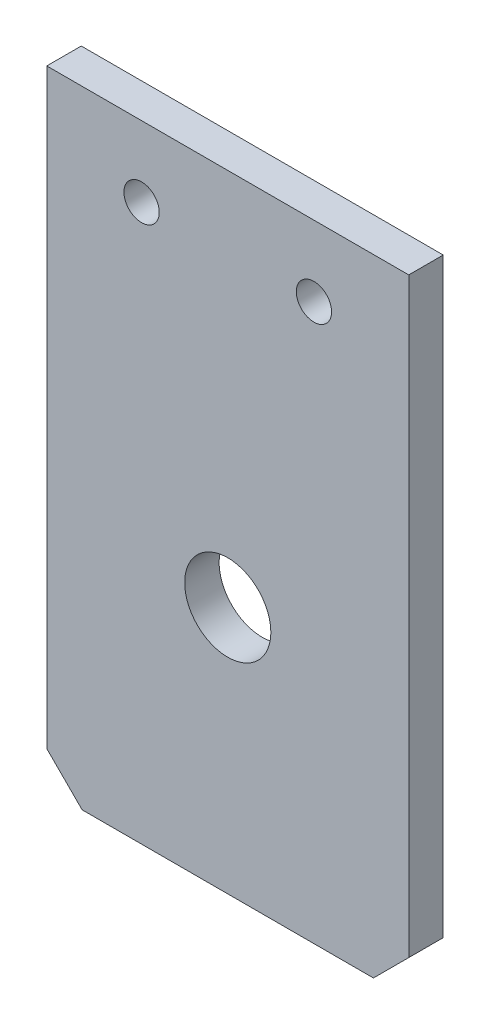
ISO-10303-21;
HEADER;
FILE_DESCRIPTION(('STEP AP214'),'2;1');
FILE_NAME('part.step','',(''),(''),'','','');
FILE_SCHEMA(('AUTOMOTIVE_DESIGN { 1 0 10303 214 1 1 1 1 }'));
ENDSEC;
DATA;
#1=APPLICATION_CONTEXT('core data for automotive mechanical design processes');
#2=APPLICATION_PROTOCOL_DEFINITION('international standard','automotive_design',2000,#1);
#3=PRODUCT_CONTEXT('',#1,'mechanical');
#4=PRODUCT('Part','Part','',(#3));
#5=PRODUCT_RELATED_PRODUCT_CATEGORY('part','',(#4));
#6=PRODUCT_DEFINITION_FORMATION('','',#4);
#7=PRODUCT_DEFINITION_CONTEXT('part definition',#1,'design');
#8=PRODUCT_DEFINITION('design','',#6,#7);
#9=PRODUCT_DEFINITION_SHAPE('','',#8);
#10=(LENGTH_UNIT() NAMED_UNIT(*) SI_UNIT(.MILLI.,.METRE.));
#11=(NAMED_UNIT(*) PLANE_ANGLE_UNIT() SI_UNIT($,.RADIAN.));
#12=(NAMED_UNIT(*) SI_UNIT($,.STERADIAN.) SOLID_ANGLE_UNIT());
#13=UNCERTAINTY_MEASURE_WITH_UNIT(LENGTH_MEASURE(1.E-05),#10,'distance_accuracy_value','');
#14=(GEOMETRIC_REPRESENTATION_CONTEXT(3) GLOBAL_UNCERTAINTY_ASSIGNED_CONTEXT((#13)) GLOBAL_UNIT_ASSIGNED_CONTEXT((#10,
#11,#12)) REPRESENTATION_CONTEXT('',''));
#15=CARTESIAN_POINT('',(0.,0.,0.));
#16=DIRECTION('',(0.,0.,1.));
#17=DIRECTION('',(1.,0.,0.));
#18=AXIS2_PLACEMENT_3D('',#15,#16,#17);
#19=CARTESIAN_POINT('',(0.,0.,4.));
#20=DIRECTION('',(0.,0.,1.));
#21=DIRECTION('',(1.,0.,0.));
#22=AXIS2_PLACEMENT_3D('',#19,#20,#21);
#23=PLANE('',#22);
#24=CARTESIAN_POINT('',(21.,21.08,4.));
#25=DIRECTION('',(0.,0.,1.));
#26=DIRECTION('',(1.,0.,0.));
#27=AXIS2_PLACEMENT_3D('',#24,#25,#26);
#28=CIRCLE('',#27,5.);
#29=CARTESIAN_POINT('',(26.,21.08,4.));
#30=VERTEX_POINT('',#29);
#31=EDGE_CURVE('E139',#30,#30,#28,.T.);
#32=ORIENTED_EDGE('',*,*,#31,.F.);
#33=EDGE_LOOP('',(#32));
#34=FACE_BOUND('',#33,.T.);
#35=CARTESIAN_POINT('',(11.,56.8,4.));
#36=DIRECTION('',(0.,0.,1.));
#37=DIRECTION('',(1.,0.,0.));
#38=AXIS2_PLACEMENT_3D('',#35,#36,#37);
#39=CIRCLE('',#38,2.04999999999999);
#40=CARTESIAN_POINT('',(13.05,56.8,4.));
#41=VERTEX_POINT('',#40);
#42=EDGE_CURVE('E116',#41,#41,#39,.T.);
#43=ORIENTED_EDGE('',*,*,#42,.F.);
#44=EDGE_LOOP('',(#43));
#45=FACE_BOUND('',#44,.T.);
#46=DIRECTION('',(1.,0.,0.));
#47=VECTOR('',#46,1.);
#48=CARTESIAN_POINT('',(0.,-7.7,4.));
#49=LINE('',#48,#47);
#50=CARTESIAN_POINT('',(4.10000000000001,-7.7,4.));
#51=VERTEX_POINT('',#50);
#52=CARTESIAN_POINT('',(37.9,-7.7,4.));
#53=VERTEX_POINT('',#52);
#54=EDGE_CURVE('E140',#51,#53,#49,.T.);
#55=ORIENTED_EDGE('',*,*,#54,.T.);
#56=DIRECTION('',(0.707106781186547,0.707106781186548,0.));
#57=VECTOR('',#56,1.);
#58=CARTESIAN_POINT('',(22.8,-22.8,4.));
#59=LINE('',#58,#57);
#60=CARTESIAN_POINT('',(42.,-3.59999999999998,4.));
#61=VERTEX_POINT('',#60);
#62=EDGE_CURVE('E95',#53,#61,#59,.T.);
#63=ORIENTED_EDGE('',*,*,#62,.T.);
#64=DIRECTION('',(0.,1.,0.));
#65=VECTOR('',#64,1.);
#66=CARTESIAN_POINT('',(42.,65.,4.));
#67=LINE('',#66,#65);
#68=CARTESIAN_POINT('',(42.,65.,4.));
#69=VERTEX_POINT('',#68);
#70=EDGE_CURVE('E87',#61,#69,#67,.T.);
#71=ORIENTED_EDGE('',*,*,#70,.T.);
#72=DIRECTION('',(-1.,0.,0.));
#73=VECTOR('',#72,1.);
#74=CARTESIAN_POINT('',(0.,65.,4.));
#75=LINE('',#74,#73);
#76=CARTESIAN_POINT('',(0.,65.,4.));
#77=VERTEX_POINT('',#76);
#78=EDGE_CURVE('E93',#69,#77,#75,.T.);
#79=ORIENTED_EDGE('',*,*,#78,.T.);
#80=DIRECTION('',(0.,-1.,0.));
#81=VECTOR('',#80,1.);
#82=CARTESIAN_POINT('',(0.,65.,4.));
#83=LINE('',#82,#81);
#84=CARTESIAN_POINT('',(0.,-3.60000000000002,4.));
#85=VERTEX_POINT('',#84);
#86=EDGE_CURVE('E96',#77,#85,#83,.T.);
#87=ORIENTED_EDGE('',*,*,#86,.T.);
#88=DIRECTION('',(0.707106781186549,-0.707106781186546,0.));
#89=VECTOR('',#88,1.);
#90=CARTESIAN_POINT('',(-1.8,-1.80000000000001,4.));
#91=LINE('',#90,#89);
#92=EDGE_CURVE('E124',#85,#51,#91,.T.);
#93=ORIENTED_EDGE('',*,*,#92,.T.);
#94=EDGE_LOOP('',(#55,#63,#71,#79,#87,#93));
#95=FACE_BOUND('',#94,.T.);
#96=CARTESIAN_POINT('',(31.,56.8,4.));
#97=DIRECTION('',(0.,0.,1.));
#98=DIRECTION('',(1.,0.,0.));
#99=AXIS2_PLACEMENT_3D('',#96,#97,#98);
#100=CIRCLE('',#99,2.04999999999999);
#101=CARTESIAN_POINT('',(33.05,56.8,4.));
#102=VERTEX_POINT('',#101);
#103=EDGE_CURVE('E183',#102,#102,#100,.T.);
#104=ORIENTED_EDGE('',*,*,#103,.F.);
#105=EDGE_LOOP('',(#104));
#106=FACE_BOUND('',#105,.T.);
#107=ADVANCED_FACE('F33',(#34,#45,#95,#106),#23,.T.);
#108=CARTESIAN_POINT('',(0.,0.,0.));
#109=DIRECTION('',(0.,0.,1.));
#110=DIRECTION('',(1.,0.,0.));
#111=AXIS2_PLACEMENT_3D('',#108,#109,#110);
#112=PLANE('',#111);
#113=CARTESIAN_POINT('',(21.,21.08,0.));
#114=DIRECTION('',(0.,0.,1.));
#115=DIRECTION('',(1.,0.,0.));
#116=AXIS2_PLACEMENT_3D('',#113,#114,#115);
#117=CIRCLE('',#116,5.);
#118=CARTESIAN_POINT('',(26.,21.08,0.));
#119=VERTEX_POINT('',#118);
#120=EDGE_CURVE('E177',#119,#119,#117,.T.);
#121=ORIENTED_EDGE('',*,*,#120,.T.);
#122=EDGE_LOOP('',(#121));
#123=FACE_BOUND('',#122,.T.);
#124=DIRECTION('',(0.,1.,0.));
#125=VECTOR('',#124,1.);
#126=CARTESIAN_POINT('',(42.,65.,0.));
#127=LINE('',#126,#125);
#128=CARTESIAN_POINT('',(42.,-3.59999999999997,0.));
#129=VERTEX_POINT('',#128);
#130=CARTESIAN_POINT('',(42.,65.,0.));
#131=VERTEX_POINT('',#130);
#132=EDGE_CURVE('E101',#129,#131,#127,.T.);
#133=ORIENTED_EDGE('',*,*,#132,.F.);
#134=DIRECTION('',(-0.707106781186547,-0.707106781186548,0.));
#135=VECTOR('',#134,1.);
#136=CARTESIAN_POINT('',(37.9,-7.7,0.));
#137=LINE('',#136,#135);
#138=CARTESIAN_POINT('',(37.9,-7.7,0.));
#139=VERTEX_POINT('',#138);
#140=EDGE_CURVE('E41',#129,#139,#137,.T.);
#141=ORIENTED_EDGE('',*,*,#140,.T.);
#142=DIRECTION('',(1.,0.,0.));
#143=VECTOR('',#142,1.);
#144=CARTESIAN_POINT('',(0.,-7.7,0.));
#145=LINE('',#144,#143);
#146=CARTESIAN_POINT('',(4.10000000000001,-7.7,0.));
#147=VERTEX_POINT('',#146);
#148=EDGE_CURVE('E132',#147,#139,#145,.T.);
#149=ORIENTED_EDGE('',*,*,#148,.F.);
#150=DIRECTION('',(-0.707106781186549,0.707106781186546,0.));
#151=VECTOR('',#150,1.);
#152=CARTESIAN_POINT('',(0.,-3.60000000000001,0.));
#153=LINE('',#152,#151);
#154=CARTESIAN_POINT('',(0.,-3.60000000000002,0.));
#155=VERTEX_POINT('',#154);
#156=EDGE_CURVE('E48',#147,#155,#153,.T.);
#157=ORIENTED_EDGE('',*,*,#156,.T.);
#158=DIRECTION('',(0.,-1.,0.));
#159=VECTOR('',#158,1.);
#160=CARTESIAN_POINT('',(0.,65.,0.));
#161=LINE('',#160,#159);
#162=CARTESIAN_POINT('',(0.,65.,0.));
#163=VERTEX_POINT('',#162);
#164=EDGE_CURVE('E114',#163,#155,#161,.T.);
#165=ORIENTED_EDGE('',*,*,#164,.F.);
#166=DIRECTION('',(-1.,0.,0.));
#167=VECTOR('',#166,1.);
#168=CARTESIAN_POINT('',(0.,65.,0.));
#169=LINE('',#168,#167);
#170=EDGE_CURVE('E118',#131,#163,#169,.T.);
#171=ORIENTED_EDGE('',*,*,#170,.F.);
#172=EDGE_LOOP('',(#133,#141,#149,#157,#165,#171));
#173=FACE_BOUND('',#172,.T.);
#174=CARTESIAN_POINT('',(11.,56.8,0.));
#175=DIRECTION('',(0.,0.,1.));
#176=DIRECTION('',(1.,0.,0.));
#177=AXIS2_PLACEMENT_3D('',#174,#175,#176);
#178=CIRCLE('',#177,2.04999999999999);
#179=CARTESIAN_POINT('',(13.05,56.8,0.));
#180=VERTEX_POINT('',#179);
#181=EDGE_CURVE('E186',#180,#180,#178,.T.);
#182=ORIENTED_EDGE('',*,*,#181,.T.);
#183=EDGE_LOOP('',(#182));
#184=FACE_BOUND('',#183,.T.);
#185=CARTESIAN_POINT('',(31.,56.8,0.));
#186=DIRECTION('',(0.,0.,1.));
#187=DIRECTION('',(1.,0.,0.));
#188=AXIS2_PLACEMENT_3D('',#185,#186,#187);
#189=CIRCLE('',#188,2.04999999999999);
#190=CARTESIAN_POINT('',(33.05,56.8,0.));
#191=VERTEX_POINT('',#190);
#192=EDGE_CURVE('E180',#191,#191,#189,.T.);
#193=ORIENTED_EDGE('',*,*,#192,.T.);
#194=EDGE_LOOP('',(#193));
#195=FACE_BOUND('',#194,.T.);
#196=ADVANCED_FACE('F130',(#123,#173,#184,#195),#112,.F.);
#197=CARTESIAN_POINT('',(0.,65.,4.));
#198=DIRECTION('',(1.,0.,0.));
#199=DIRECTION('',(0.,1.,0.));
#200=AXIS2_PLACEMENT_3D('',#197,#198,#199);
#201=PLANE('',#200);
#202=ORIENTED_EDGE('',*,*,#164,.T.);
#203=DIRECTION('',(0.,0.,1.));
#204=VECTOR('',#203,1.);
#205=CARTESIAN_POINT('',(0.,-3.60000000000001,4.));
#206=LINE('',#205,#204);
#207=EDGE_CURVE('E11',#155,#85,#206,.T.);
#208=ORIENTED_EDGE('',*,*,#207,.T.);
#209=ORIENTED_EDGE('',*,*,#86,.F.);
#210=DIRECTION('',(0.,0.,-1.));
#211=VECTOR('',#210,1.);
#212=CARTESIAN_POINT('',(0.,65.,4.));
#213=LINE('',#212,#211);
#214=EDGE_CURVE('E105',#77,#163,#213,.T.);
#215=ORIENTED_EDGE('',*,*,#214,.T.);
#216=EDGE_LOOP('',(#202,#208,#209,#215));
#217=FACE_BOUND('',#216,.T.);
#218=ADVANCED_FACE('F158',(#217),#201,.F.);
#219=CARTESIAN_POINT('',(42.,65.,4.));
#220=DIRECTION('',(-1.,0.,0.));
#221=DIRECTION('',(0.,-1.,0.));
#222=AXIS2_PLACEMENT_3D('',#219,#220,#221);
#223=PLANE('',#222);
#224=ORIENTED_EDGE('',*,*,#70,.F.);
#225=DIRECTION('',(0.,0.,-1.));
#226=VECTOR('',#225,1.);
#227=CARTESIAN_POINT('',(42.,-3.59999999999998,0.));
#228=LINE('',#227,#226);
#229=EDGE_CURVE('E56',#61,#129,#228,.T.);
#230=ORIENTED_EDGE('',*,*,#229,.T.);
#231=ORIENTED_EDGE('',*,*,#132,.T.);
#232=DIRECTION('',(0.,0.,-1.));
#233=VECTOR('',#232,1.);
#234=CARTESIAN_POINT('',(42.,65.,4.));
#235=LINE('',#234,#233);
#236=EDGE_CURVE('E99',#69,#131,#235,.T.);
#237=ORIENTED_EDGE('',*,*,#236,.F.);
#238=EDGE_LOOP('',(#224,#230,#231,#237));
#239=FACE_BOUND('',#238,.T.);
#240=ADVANCED_FACE('F100',(#239),#223,.F.);
#241=CARTESIAN_POINT('',(0.,65.,4.));
#242=DIRECTION('',(0.,-1.,0.));
#243=DIRECTION('',(0.,0.,-1.));
#244=AXIS2_PLACEMENT_3D('',#241,#242,#243);
#245=PLANE('',#244);
#246=ORIENTED_EDGE('',*,*,#170,.T.);
#247=ORIENTED_EDGE('',*,*,#214,.F.);
#248=ORIENTED_EDGE('',*,*,#78,.F.);
#249=ORIENTED_EDGE('',*,*,#236,.T.);
#250=EDGE_LOOP('',(#246,#247,#248,#249));
#251=FACE_BOUND('',#250,.T.);
#252=ADVANCED_FACE('F107',(#251),#245,.F.);
#253=CARTESIAN_POINT('',(11.,56.8,4.));
#254=DIRECTION('',(0.,0.,-1.));
#255=DIRECTION('',(-1.,0.,0.));
#256=AXIS2_PLACEMENT_3D('',#253,#254,#255);
#257=CYLINDRICAL_SURFACE('',#256,2.04999999999999);
#258=ORIENTED_EDGE('',*,*,#42,.T.);
#259=EDGE_LOOP('',(#258));
#260=FACE_BOUND('',#259,.T.);
#261=ORIENTED_EDGE('',*,*,#181,.F.);
#262=EDGE_LOOP('',(#261));
#263=FACE_BOUND('',#262,.T.);
#264=ADVANCED_FACE('F164',(#260,#263),#257,.F.);
#265=CARTESIAN_POINT('',(31.,56.8,4.));
#266=DIRECTION('',(0.,0.,-1.));
#267=DIRECTION('',(-1.,0.,0.));
#268=AXIS2_PLACEMENT_3D('',#265,#266,#267);
#269=CYLINDRICAL_SURFACE('',#268,2.04999999999999);
#270=ORIENTED_EDGE('',*,*,#103,.T.);
#271=EDGE_LOOP('',(#270));
#272=FACE_BOUND('',#271,.T.);
#273=ORIENTED_EDGE('',*,*,#192,.F.);
#274=EDGE_LOOP('',(#273));
#275=FACE_BOUND('',#274,.T.);
#276=ADVANCED_FACE('F196',(#272,#275),#269,.F.);
#277=CARTESIAN_POINT('',(21.,21.08,0.));
#278=DIRECTION('',(0.,0.,1.));
#279=DIRECTION('',(1.,0.,0.));
#280=AXIS2_PLACEMENT_3D('',#277,#278,#279);
#281=CYLINDRICAL_SURFACE('',#280,5.);
#282=ORIENTED_EDGE('',*,*,#120,.F.);
#283=EDGE_LOOP('',(#282));
#284=FACE_BOUND('',#283,.T.);
#285=ORIENTED_EDGE('',*,*,#31,.T.);
#286=EDGE_LOOP('',(#285));
#287=FACE_BOUND('',#286,.T.);
#288=ADVANCED_FACE('F149',(#284,#287),#281,.F.);
#289=CARTESIAN_POINT('',(0.,-7.7,0.));
#290=DIRECTION('',(0.,-1.,0.));
#291=DIRECTION('',(0.,0.,-1.));
#292=AXIS2_PLACEMENT_3D('',#289,#290,#291);
#293=PLANE('',#292);
#294=ORIENTED_EDGE('',*,*,#148,.T.);
#295=DIRECTION('',(0.,0.,1.));
#296=VECTOR('',#295,1.);
#297=CARTESIAN_POINT('',(37.9,-7.7,4.));
#298=LINE('',#297,#296);
#299=EDGE_CURVE('E121',#139,#53,#298,.T.);
#300=ORIENTED_EDGE('',*,*,#299,.T.);
#301=ORIENTED_EDGE('',*,*,#54,.F.);
#302=DIRECTION('',(0.,0.,-1.));
#303=VECTOR('',#302,1.);
#304=CARTESIAN_POINT('',(4.10000000000001,-7.7,0.));
#305=LINE('',#304,#303);
#306=EDGE_CURVE('E104',#51,#147,#305,.T.);
#307=ORIENTED_EDGE('',*,*,#306,.T.);
#308=EDGE_LOOP('',(#294,#300,#301,#307));
#309=FACE_BOUND('',#308,.T.);
#310=ADVANCED_FACE('F136',(#309),#293,.T.);
#311=CARTESIAN_POINT('',(37.9,-7.7,0.));
#312=DIRECTION('',(0.707106781186548,-0.707106781186547,0.));
#313=DIRECTION('',(0.,0.,-1.));
#314=AXIS2_PLACEMENT_3D('',#311,#312,#313);
#315=PLANE('',#314);
#316=ORIENTED_EDGE('',*,*,#140,.F.);
#317=ORIENTED_EDGE('',*,*,#229,.F.);
#318=ORIENTED_EDGE('',*,*,#62,.F.);
#319=ORIENTED_EDGE('',*,*,#299,.F.);
#320=EDGE_LOOP('',(#316,#317,#318,#319));
#321=FACE_BOUND('',#320,.T.);
#322=ADVANCED_FACE('F142',(#321),#315,.T.);
#323=CARTESIAN_POINT('',(0.,-3.60000000000001,4.));
#324=DIRECTION('',(-0.707106781186546,-0.707106781186549,0.));
#325=DIRECTION('',(0.,0.,-1.));
#326=AXIS2_PLACEMENT_3D('',#323,#324,#325);
#327=PLANE('',#326);
#328=ORIENTED_EDGE('',*,*,#156,.F.);
#329=ORIENTED_EDGE('',*,*,#306,.F.);
#330=ORIENTED_EDGE('',*,*,#92,.F.);
#331=ORIENTED_EDGE('',*,*,#207,.F.);
#332=EDGE_LOOP('',(#328,#329,#330,#331));
#333=FACE_BOUND('',#332,.T.);
#334=ADVANCED_FACE('F35',(#333),#327,.T.);
#335=CLOSED_SHELL('',(#107,#196,#218,#240,#252,#264,#276,#288,#310,#322,#334));
#336=MANIFOLD_SOLID_BREP('B2',#335);
#337=ADVANCED_BREP_SHAPE_REPRESENTATION('',(#18,#336),#14);
#338=SHAPE_DEFINITION_REPRESENTATION(#9,#337);
ENDSEC;
END-ISO-10303-21;
